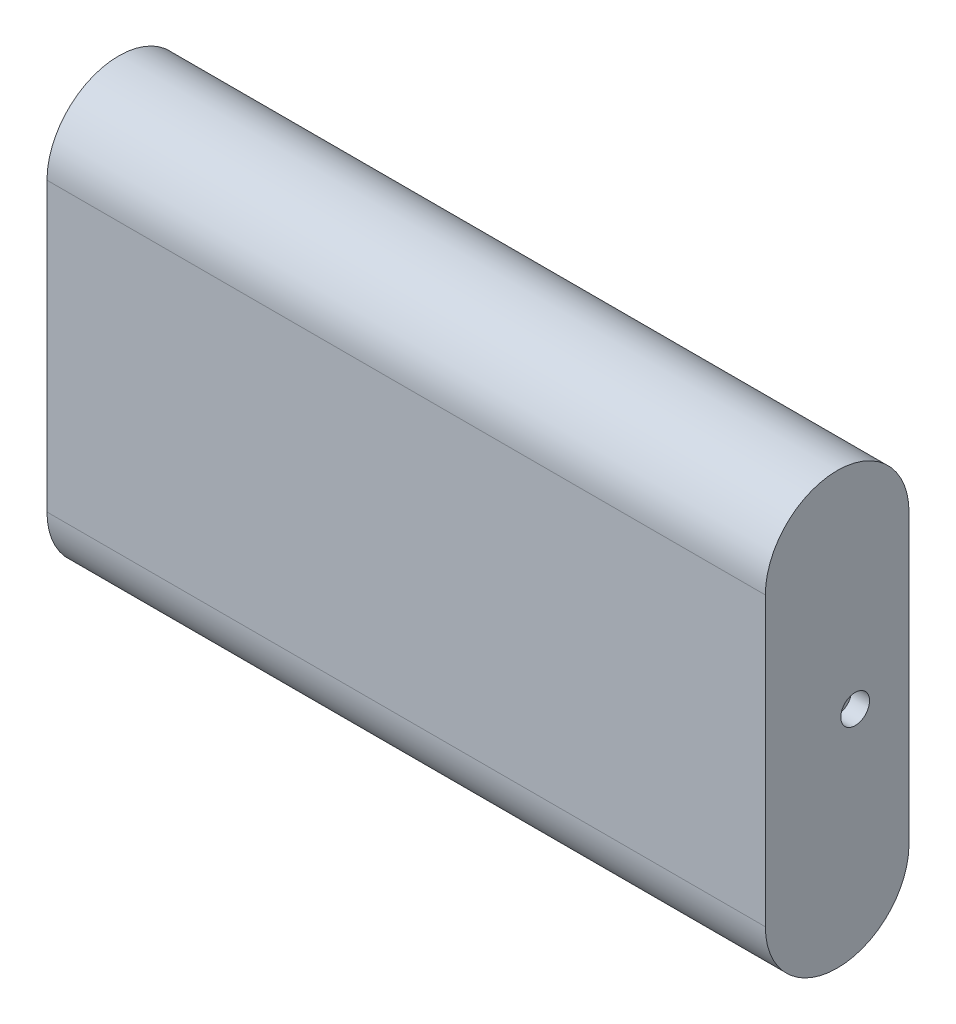
ISO-10303-21;
HEADER;
FILE_DESCRIPTION(('STEP AP214'),'2;1');
FILE_NAME('part.step','',(''),(''),'','','');
FILE_SCHEMA(('AUTOMOTIVE_DESIGN { 1 0 10303 214 1 1 1 1 }'));
ENDSEC;
DATA;
#1=APPLICATION_CONTEXT('core data for automotive mechanical design processes');
#2=APPLICATION_PROTOCOL_DEFINITION('international standard','automotive_design',2000,#1);
#3=PRODUCT_CONTEXT('',#1,'mechanical');
#4=PRODUCT('Part','Part','',(#3));
#5=PRODUCT_RELATED_PRODUCT_CATEGORY('part','',(#4));
#6=PRODUCT_DEFINITION_FORMATION('','',#4);
#7=PRODUCT_DEFINITION_CONTEXT('part definition',#1,'design');
#8=PRODUCT_DEFINITION('design','',#6,#7);
#9=PRODUCT_DEFINITION_SHAPE('','',#8);
#10=(LENGTH_UNIT() NAMED_UNIT(*) SI_UNIT(.MILLI.,.METRE.));
#11=(NAMED_UNIT(*) PLANE_ANGLE_UNIT() SI_UNIT($,.RADIAN.));
#12=(NAMED_UNIT(*) SI_UNIT($,.STERADIAN.) SOLID_ANGLE_UNIT());
#13=UNCERTAINTY_MEASURE_WITH_UNIT(LENGTH_MEASURE(1.E-05),#10,'distance_accuracy_value','');
#14=(GEOMETRIC_REPRESENTATION_CONTEXT(3) GLOBAL_UNCERTAINTY_ASSIGNED_CONTEXT((#13)) GLOBAL_UNIT_ASSIGNED_CONTEXT((#10,
#11,#12)) REPRESENTATION_CONTEXT('',''));
#15=CARTESIAN_POINT('',(0.,0.,0.));
#16=DIRECTION('',(0.,0.,1.));
#17=DIRECTION('',(1.,0.,0.));
#18=AXIS2_PLACEMENT_3D('',#15,#16,#17);
#19=CARTESIAN_POINT('',(-100.,-40.,20.));
#20=DIRECTION('',(1.,0.,0.));
#21=DIRECTION('',(0.,0.,-1.));
#22=AXIS2_PLACEMENT_3D('',#19,#20,#21);
#23=CYLINDRICAL_SURFACE('',#22,20.);
#24=DIRECTION('',(1.,0.,0.));
#25=VECTOR('',#24,1.);
#26=CARTESIAN_POINT('',(0.,-40.,40.));
#27=LINE('',#26,#25);
#28=CARTESIAN_POINT('',(-100.,-40.,40.));
#29=VERTEX_POINT('',#28);
#30=CARTESIAN_POINT('',(100.,-40.,40.));
#31=VERTEX_POINT('',#30);
#32=EDGE_CURVE('E80',#29,#31,#27,.T.);
#33=ORIENTED_EDGE('',*,*,#32,.F.);
#34=CARTESIAN_POINT('',(-100.,-40.,20.));
#35=DIRECTION('',(1.,0.,0.));
#36=DIRECTION('',(0.,0.,-1.));
#37=AXIS2_PLACEMENT_3D('',#34,#35,#36);
#38=CIRCLE('',#37,20.);
#39=CARTESIAN_POINT('',(-100.,-40.,0.));
#40=VERTEX_POINT('',#39);
#41=EDGE_CURVE('E43',#40,#29,#38,.F.);
#42=ORIENTED_EDGE('',*,*,#41,.F.);
#43=DIRECTION('',(-1.,0.,0.));
#44=VECTOR('',#43,1.);
#45=CARTESIAN_POINT('',(-100.,-40.,0.));
#46=LINE('',#45,#44);
#47=CARTESIAN_POINT('',(100.,-40.,0.));
#48=VERTEX_POINT('',#47);
#49=EDGE_CURVE('E104',#48,#40,#46,.T.);
#50=ORIENTED_EDGE('',*,*,#49,.F.);
#51=CARTESIAN_POINT('',(100.,-40.,20.));
#52=DIRECTION('',(-1.,0.,0.));
#53=DIRECTION('',(0.,0.,1.));
#54=AXIS2_PLACEMENT_3D('',#51,#52,#53);
#55=CIRCLE('',#54,20.);
#56=EDGE_CURVE('E11',#31,#48,#55,.F.);
#57=ORIENTED_EDGE('',*,*,#56,.F.);
#58=EDGE_LOOP('',(#33,#42,#50,#57));
#59=FACE_BOUND('',#58,.T.);
#60=ADVANCED_FACE('F35',(#59),#23,.T.);
#61=CARTESIAN_POINT('',(100.,40.,20.));
#62=DIRECTION('',(-1.,0.,0.));
#63=DIRECTION('',(0.,0.,1.));
#64=AXIS2_PLACEMENT_3D('',#61,#62,#63);
#65=CYLINDRICAL_SURFACE('',#64,20.);
#66=DIRECTION('',(-1.,0.,0.));
#67=VECTOR('',#66,1.);
#68=CARTESIAN_POINT('',(0.,40.,40.));
#69=LINE('',#68,#67);
#70=CARTESIAN_POINT('',(100.,40.,40.));
#71=VERTEX_POINT('',#70);
#72=CARTESIAN_POINT('',(-100.,40.,40.));
#73=VERTEX_POINT('',#72);
#74=EDGE_CURVE('E78',#71,#73,#69,.T.);
#75=ORIENTED_EDGE('',*,*,#74,.F.);
#76=CARTESIAN_POINT('',(100.,40.,20.));
#77=DIRECTION('',(-1.,0.,0.));
#78=DIRECTION('',(0.,0.,1.));
#79=AXIS2_PLACEMENT_3D('',#76,#77,#78);
#80=CIRCLE('',#79,20.);
#81=CARTESIAN_POINT('',(100.,40.,0.));
#82=VERTEX_POINT('',#81);
#83=EDGE_CURVE('E85',#82,#71,#80,.F.);
#84=ORIENTED_EDGE('',*,*,#83,.F.);
#85=DIRECTION('',(1.,0.,0.));
#86=VECTOR('',#85,1.);
#87=CARTESIAN_POINT('',(100.,40.,0.));
#88=LINE('',#87,#86);
#89=CARTESIAN_POINT('',(-100.,40.,0.));
#90=VERTEX_POINT('',#89);
#91=EDGE_CURVE('E93',#90,#82,#88,.T.);
#92=ORIENTED_EDGE('',*,*,#91,.F.);
#93=CARTESIAN_POINT('',(-100.,40.,20.));
#94=DIRECTION('',(1.,0.,0.));
#95=DIRECTION('',(0.,0.,-1.));
#96=AXIS2_PLACEMENT_3D('',#93,#94,#95);
#97=CIRCLE('',#96,20.);
#98=EDGE_CURVE('E92',#73,#90,#97,.F.);
#99=ORIENTED_EDGE('',*,*,#98,.F.);
#100=EDGE_LOOP('',(#75,#84,#92,#99));
#101=FACE_BOUND('',#100,.T.);
#102=ADVANCED_FACE('F95',(#101),#65,.T.);
#103=CARTESIAN_POINT('',(100.,-60.,40.));
#104=DIRECTION('',(-1.,0.,0.));
#105=DIRECTION('',(0.,0.,1.));
#106=AXIS2_PLACEMENT_3D('',#103,#104,#105);
#107=PLANE('',#106);
#108=CARTESIAN_POINT('',(100.,0.,15.));
#109=DIRECTION('',(-1.,0.,0.));
#110=DIRECTION('',(0.,0.,1.));
#111=AXIS2_PLACEMENT_3D('',#108,#109,#110);
#112=CIRCLE('',#111,4.);
#113=CARTESIAN_POINT('',(100.,0.,19.));
#114=VERTEX_POINT('',#113);
#115=EDGE_CURVE('E119',#114,#114,#112,.T.);
#116=ORIENTED_EDGE('',*,*,#115,.T.);
#117=EDGE_LOOP('',(#116));
#118=FACE_BOUND('',#117,.T.);
#119=DIRECTION('',(0.,1.,0.));
#120=VECTOR('',#119,1.);
#121=CARTESIAN_POINT('',(100.,-60.,40.));
#122=LINE('',#121,#120);
#123=EDGE_CURVE('E73',#31,#71,#122,.T.);
#124=ORIENTED_EDGE('',*,*,#123,.F.);
#125=ORIENTED_EDGE('',*,*,#56,.T.);
#126=DIRECTION('',(0.,1.,0.));
#127=VECTOR('',#126,1.);
#128=CARTESIAN_POINT('',(100.,-60.,0.));
#129=LINE('',#128,#127);
#130=EDGE_CURVE('E88',#48,#82,#129,.T.);
#131=ORIENTED_EDGE('',*,*,#130,.T.);
#132=ORIENTED_EDGE('',*,*,#83,.T.);
#133=EDGE_LOOP('',(#124,#125,#131,#132));
#134=FACE_BOUND('',#133,.T.);
#135=ADVANCED_FACE('F86',(#118,#134),#107,.F.);
#136=CARTESIAN_POINT('',(-100.,-60.,40.));
#137=DIRECTION('',(1.,0.,0.));
#138=DIRECTION('',(0.,0.,-1.));
#139=AXIS2_PLACEMENT_3D('',#136,#137,#138);
#140=PLANE('',#139);
#141=CARTESIAN_POINT('',(-100.,0.,15.));
#142=DIRECTION('',(-1.,0.,0.));
#143=DIRECTION('',(0.,0.,1.));
#144=AXIS2_PLACEMENT_3D('',#141,#142,#143);
#145=CIRCLE('',#144,4.);
#146=CARTESIAN_POINT('',(-100.,0.,19.));
#147=VERTEX_POINT('',#146);
#148=EDGE_CURVE('E113',#147,#147,#145,.T.);
#149=ORIENTED_EDGE('',*,*,#148,.F.);
#150=EDGE_LOOP('',(#149));
#151=FACE_BOUND('',#150,.T.);
#152=DIRECTION('',(0.,-1.,0.));
#153=VECTOR('',#152,1.);
#154=CARTESIAN_POINT('',(-100.,-60.,0.));
#155=LINE('',#154,#153);
#156=EDGE_CURVE('E82',#90,#40,#155,.T.);
#157=ORIENTED_EDGE('',*,*,#156,.T.);
#158=ORIENTED_EDGE('',*,*,#41,.T.);
#159=DIRECTION('',(0.,-1.,0.));
#160=VECTOR('',#159,1.);
#161=CARTESIAN_POINT('',(-100.,-60.,40.));
#162=LINE('',#161,#160);
#163=EDGE_CURVE('E81',#73,#29,#162,.T.);
#164=ORIENTED_EDGE('',*,*,#163,.F.);
#165=ORIENTED_EDGE('',*,*,#98,.T.);
#166=EDGE_LOOP('',(#157,#158,#164,#165));
#167=FACE_BOUND('',#166,.T.);
#168=ADVANCED_FACE('F107',(#151,#167),#140,.F.);
#169=CARTESIAN_POINT('',(0.,0.,40.));
#170=DIRECTION('',(0.,0.,-1.));
#171=DIRECTION('',(-1.,0.,0.));
#172=AXIS2_PLACEMENT_3D('',#169,#170,#171);
#173=PLANE('',#172);
#174=ORIENTED_EDGE('',*,*,#163,.T.);
#175=ORIENTED_EDGE('',*,*,#32,.T.);
#176=ORIENTED_EDGE('',*,*,#123,.T.);
#177=ORIENTED_EDGE('',*,*,#74,.T.);
#178=EDGE_LOOP('',(#174,#175,#176,#177));
#179=FACE_BOUND('',#178,.T.);
#180=ADVANCED_FACE('F76',(#179),#173,.F.);
#181=CARTESIAN_POINT('',(0.,0.,0.));
#182=DIRECTION('',(0.,0.,-1.));
#183=DIRECTION('',(-1.,0.,0.));
#184=AXIS2_PLACEMENT_3D('',#181,#182,#183);
#185=PLANE('',#184);
#186=ORIENTED_EDGE('',*,*,#130,.F.);
#187=ORIENTED_EDGE('',*,*,#49,.T.);
#188=ORIENTED_EDGE('',*,*,#156,.F.);
#189=ORIENTED_EDGE('',*,*,#91,.T.);
#190=EDGE_LOOP('',(#186,#187,#188,#189));
#191=FACE_BOUND('',#190,.T.);
#192=ADVANCED_FACE('F110',(#191),#185,.T.);
#193=CARTESIAN_POINT('',(-95.,0.,15.));
#194=DIRECTION('',(-1.,0.,0.));
#195=DIRECTION('',(0.,0.,1.));
#196=AXIS2_PLACEMENT_3D('',#193,#194,#195);
#197=CYLINDRICAL_SURFACE('',#196,4.);
#198=CARTESIAN_POINT('',(-95.,0.,15.));
#199=DIRECTION('',(-1.,0.,0.));
#200=DIRECTION('',(0.,0.,1.));
#201=AXIS2_PLACEMENT_3D('',#198,#199,#200);
#202=CIRCLE('',#201,4.);
#203=CARTESIAN_POINT('',(-95.,0.,19.));
#204=VERTEX_POINT('',#203);
#205=EDGE_CURVE('E111',#204,#204,#202,.T.);
#206=ORIENTED_EDGE('',*,*,#205,.F.);
#207=EDGE_LOOP('',(#206));
#208=FACE_BOUND('',#207,.T.);
#209=ORIENTED_EDGE('',*,*,#148,.T.);
#210=EDGE_LOOP('',(#209));
#211=FACE_BOUND('',#210,.T.);
#212=ADVANCED_FACE('F154',(#208,#211),#197,.F.);
#213=CARTESIAN_POINT('',(-95.,0.,15.));
#214=DIRECTION('',(-1.,0.,0.));
#215=DIRECTION('',(0.,0.,1.));
#216=AXIS2_PLACEMENT_3D('',#213,#214,#215);
#217=PLANE('',#216);
#218=ORIENTED_EDGE('',*,*,#205,.T.);
#219=EDGE_LOOP('',(#218));
#220=FACE_BOUND('',#219,.T.);
#221=ADVANCED_FACE('F134',(#220),#217,.T.);
#222=CARTESIAN_POINT('',(95.,0.,15.));
#223=DIRECTION('',(1.,0.,0.));
#224=DIRECTION('',(0.,0.,-1.));
#225=AXIS2_PLACEMENT_3D('',#222,#223,#224);
#226=CYLINDRICAL_SURFACE('',#225,4.);
#227=CARTESIAN_POINT('',(95.,0.,15.));
#228=DIRECTION('',(-1.,0.,0.));
#229=DIRECTION('',(0.,0.,1.));
#230=AXIS2_PLACEMENT_3D('',#227,#228,#229);
#231=CIRCLE('',#230,4.);
#232=CARTESIAN_POINT('',(95.,0.,19.));
#233=VERTEX_POINT('',#232);
#234=EDGE_CURVE('E117',#233,#233,#231,.T.);
#235=ORIENTED_EDGE('',*,*,#234,.T.);
#236=EDGE_LOOP('',(#235));
#237=FACE_BOUND('',#236,.T.);
#238=ORIENTED_EDGE('',*,*,#115,.F.);
#239=EDGE_LOOP('',(#238));
#240=FACE_BOUND('',#239,.T.);
#241=ADVANCED_FACE('F125',(#237,#240),#226,.F.);
#242=CARTESIAN_POINT('',(95.,0.,15.));
#243=DIRECTION('',(1.,0.,0.));
#244=DIRECTION('',(0.,0.,1.));
#245=AXIS2_PLACEMENT_3D('',#242,#243,#244);
#246=PLANE('',#245);
#247=ORIENTED_EDGE('',*,*,#234,.F.);
#248=EDGE_LOOP('',(#247));
#249=FACE_BOUND('',#248,.T.);
#250=ADVANCED_FACE('F128',(#249),#246,.T.);
#251=CLOSED_SHELL('',(#60,#102,#135,#168,#180,#192,#212,#221,#241,#250));
#252=MANIFOLD_SOLID_BREP('B2',#251);
#253=ADVANCED_BREP_SHAPE_REPRESENTATION('',(#18,#252),#14);
#254=SHAPE_DEFINITION_REPRESENTATION(#9,#253);
ENDSEC;
END-ISO-10303-21;
